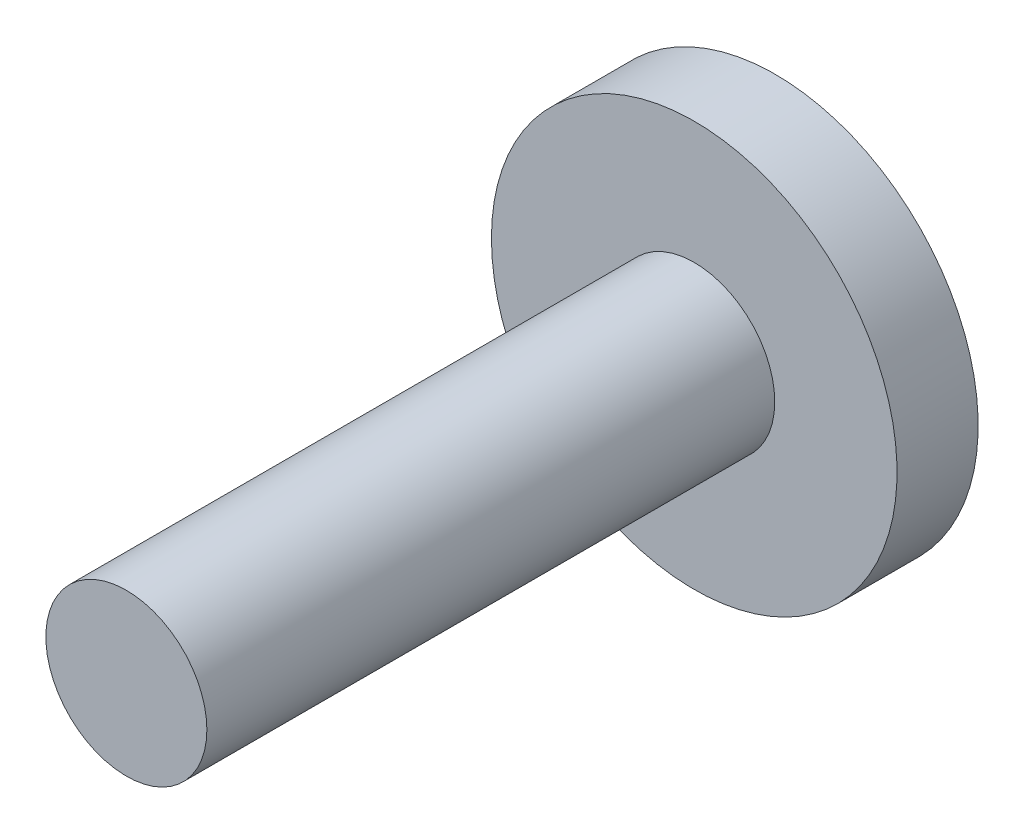
ISO-10303-21;
HEADER;
FILE_DESCRIPTION(('STEP AP214'),'2;1');
FILE_NAME('part.step','',(''),(''),'','','');
FILE_SCHEMA(('AUTOMOTIVE_DESIGN { 1 0 10303 214 1 1 1 1 }'));
ENDSEC;
DATA;
#1=APPLICATION_CONTEXT('core data for automotive mechanical design processes');
#2=APPLICATION_PROTOCOL_DEFINITION('international standard','automotive_design',2000,#1);
#3=PRODUCT_CONTEXT('',#1,'mechanical');
#4=PRODUCT('Part','Part','',(#3));
#5=PRODUCT_RELATED_PRODUCT_CATEGORY('part','',(#4));
#6=PRODUCT_DEFINITION_FORMATION('','',#4);
#7=PRODUCT_DEFINITION_CONTEXT('part definition',#1,'design');
#8=PRODUCT_DEFINITION('design','',#6,#7);
#9=PRODUCT_DEFINITION_SHAPE('','',#8);
#10=(LENGTH_UNIT() NAMED_UNIT(*) SI_UNIT(.MILLI.,.METRE.));
#11=(NAMED_UNIT(*) PLANE_ANGLE_UNIT() SI_UNIT($,.RADIAN.));
#12=(NAMED_UNIT(*) SI_UNIT($,.STERADIAN.) SOLID_ANGLE_UNIT());
#13=UNCERTAINTY_MEASURE_WITH_UNIT(LENGTH_MEASURE(1.E-05),#10,'distance_accuracy_value','');
#14=(GEOMETRIC_REPRESENTATION_CONTEXT(3) GLOBAL_UNCERTAINTY_ASSIGNED_CONTEXT((#13)) GLOBAL_UNIT_ASSIGNED_CONTEXT((#10,
#11,#12)) REPRESENTATION_CONTEXT('',''));
#15=CARTESIAN_POINT('',(0.,0.,0.));
#16=DIRECTION('',(0.,0.,1.));
#17=DIRECTION('',(1.,0.,0.));
#18=AXIS2_PLACEMENT_3D('',#15,#16,#17);
#19=CARTESIAN_POINT('',(0.,0.,14.));
#20=DIRECTION('',(0.,0.,-1.));
#21=DIRECTION('',(-1.,0.,0.));
#22=AXIS2_PLACEMENT_3D('',#19,#20,#21);
#23=CYLINDRICAL_SURFACE('',#22,1.985);
#24=CARTESIAN_POINT('',(0.,0.,14.));
#25=DIRECTION('',(0.,0.,1.));
#26=DIRECTION('',(1.,0.,0.));
#27=AXIS2_PLACEMENT_3D('',#24,#25,#26);
#28=CIRCLE('',#27,1.985);
#29=CARTESIAN_POINT('',(1.985,0.,14.));
#30=VERTEX_POINT('',#29);
#31=EDGE_CURVE('E10',#30,#30,#28,.T.);
#32=ORIENTED_EDGE('',*,*,#31,.F.);
#33=EDGE_LOOP('',(#32));
#34=FACE_BOUND('',#33,.T.);
#35=CARTESIAN_POINT('',(0.,0.,0.));
#36=DIRECTION('',(0.,0.,1.));
#37=DIRECTION('',(1.,0.,0.));
#38=AXIS2_PLACEMENT_3D('',#35,#36,#37);
#39=CIRCLE('',#38,1.985);
#40=CARTESIAN_POINT('',(1.985,0.,0.));
#41=VERTEX_POINT('',#40);
#42=EDGE_CURVE('E40',#41,#41,#39,.T.);
#43=ORIENTED_EDGE('',*,*,#42,.T.);
#44=EDGE_LOOP('',(#43));
#45=FACE_BOUND('',#44,.T.);
#46=ADVANCED_FACE('F37',(#34,#45),#23,.T.);
#47=CARTESIAN_POINT('',(0.,0.,14.));
#48=DIRECTION('',(0.,0.,1.));
#49=DIRECTION('',(1.,0.,0.));
#50=AXIS2_PLACEMENT_3D('',#47,#48,#49);
#51=PLANE('',#50);
#52=ORIENTED_EDGE('',*,*,#31,.T.);
#53=EDGE_LOOP('',(#52));
#54=FACE_BOUND('',#53,.T.);
#55=ADVANCED_FACE('F60',(#54),#51,.T.);
#56=CARTESIAN_POINT('',(0.,0.,-2.));
#57=DIRECTION('',(0.,0.,1.));
#58=DIRECTION('',(1.,0.,0.));
#59=AXIS2_PLACEMENT_3D('',#56,#57,#58);
#60=CYLINDRICAL_SURFACE('',#59,5.);
#61=CARTESIAN_POINT('',(0.,0.,-2.));
#62=DIRECTION('',(0.,0.,-1.));
#63=DIRECTION('',(-1.,0.,0.));
#64=AXIS2_PLACEMENT_3D('',#61,#62,#63);
#65=CIRCLE('',#64,5.);
#66=CARTESIAN_POINT('',(-5.,0.,-2.));
#67=VERTEX_POINT('',#66);
#68=EDGE_CURVE('E47',#67,#67,#65,.T.);
#69=ORIENTED_EDGE('',*,*,#68,.F.);
#70=EDGE_LOOP('',(#69));
#71=FACE_BOUND('',#70,.T.);
#72=CARTESIAN_POINT('',(0.,0.,0.));
#73=DIRECTION('',(0.,0.,-1.));
#74=DIRECTION('',(-1.,0.,0.));
#75=AXIS2_PLACEMENT_3D('',#72,#73,#74);
#76=CIRCLE('',#75,5.);
#77=CARTESIAN_POINT('',(-5.,0.,0.));
#78=VERTEX_POINT('',#77);
#79=EDGE_CURVE('E49',#78,#78,#76,.T.);
#80=ORIENTED_EDGE('',*,*,#79,.T.);
#81=EDGE_LOOP('',(#80));
#82=FACE_BOUND('',#81,.T.);
#83=ADVANCED_FACE('F57',(#71,#82),#60,.T.);
#84=CARTESIAN_POINT('',(0.,0.,-2.));
#85=DIRECTION('',(0.,0.,-1.));
#86=DIRECTION('',(-1.,0.,0.));
#87=AXIS2_PLACEMENT_3D('',#84,#85,#86);
#88=PLANE('',#87);
#89=ORIENTED_EDGE('',*,*,#68,.T.);
#90=EDGE_LOOP('',(#89));
#91=FACE_BOUND('',#90,.T.);
#92=ADVANCED_FACE('F55',(#91),#88,.T.);
#93=CARTESIAN_POINT('',(0.,0.,0.));
#94=DIRECTION('',(0.,0.,-1.));
#95=DIRECTION('',(-1.,0.,0.));
#96=AXIS2_PLACEMENT_3D('',#93,#94,#95);
#97=PLANE('',#96);
#98=ORIENTED_EDGE('',*,*,#42,.F.);
#99=EDGE_LOOP('',(#98));
#100=FACE_BOUND('',#99,.T.);
#101=ORIENTED_EDGE('',*,*,#79,.F.);
#102=EDGE_LOOP('',(#101));
#103=FACE_BOUND('',#102,.T.);
#104=ADVANCED_FACE('F64',(#100,#103),#97,.F.);
#105=CLOSED_SHELL('',(#46,#55,#83,#92,#104));
#106=MANIFOLD_SOLID_BREP('B2',#105);
#107=ADVANCED_BREP_SHAPE_REPRESENTATION('',(#18,#106),#14);
#108=SHAPE_DEFINITION_REPRESENTATION(#9,#107);
ENDSEC;
END-ISO-10303-21;
